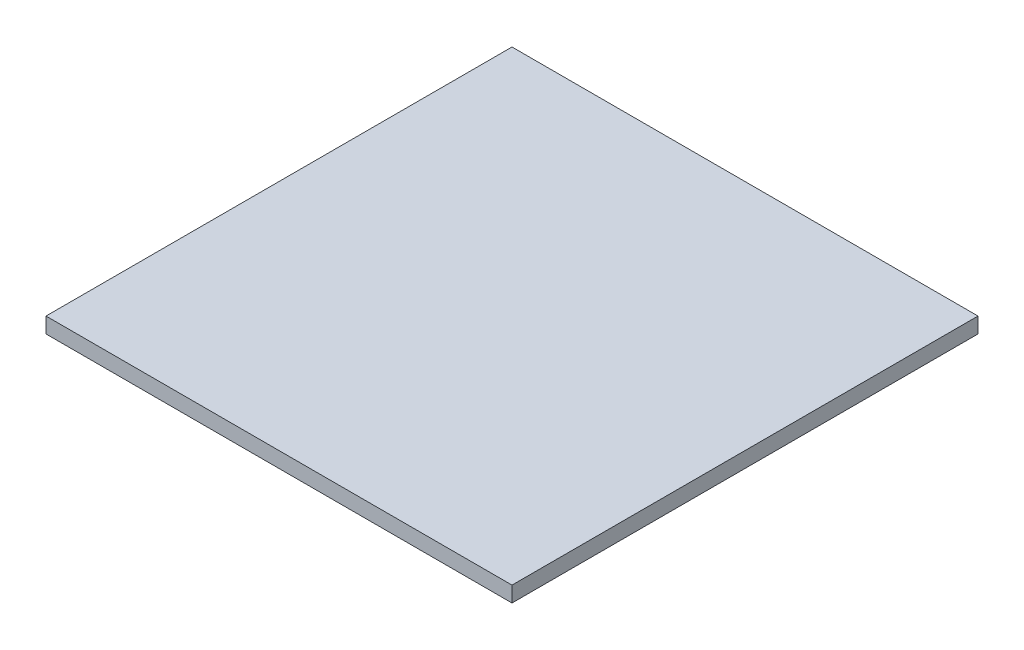
ISO-10303-21;
HEADER;
FILE_DESCRIPTION(('STEP AP214'),'2;1');
FILE_NAME('part.step','',(''),(''),'','','');
FILE_SCHEMA(('AUTOMOTIVE_DESIGN { 1 0 10303 214 1 1 1 1 }'));
ENDSEC;
DATA;
#1=APPLICATION_CONTEXT('core data for automotive mechanical design processes');
#2=APPLICATION_PROTOCOL_DEFINITION('international standard','automotive_design',2000,#1);
#3=PRODUCT_CONTEXT('',#1,'mechanical');
#4=PRODUCT('Part','Part','',(#3));
#5=PRODUCT_RELATED_PRODUCT_CATEGORY('part','',(#4));
#6=PRODUCT_DEFINITION_FORMATION('','',#4);
#7=PRODUCT_DEFINITION_CONTEXT('part definition',#1,'design');
#8=PRODUCT_DEFINITION('design','',#6,#7);
#9=PRODUCT_DEFINITION_SHAPE('','',#8);
#10=(LENGTH_UNIT() NAMED_UNIT(*) SI_UNIT(.MILLI.,.METRE.));
#11=(NAMED_UNIT(*) PLANE_ANGLE_UNIT() SI_UNIT($,.RADIAN.));
#12=(NAMED_UNIT(*) SI_UNIT($,.STERADIAN.) SOLID_ANGLE_UNIT());
#13=UNCERTAINTY_MEASURE_WITH_UNIT(LENGTH_MEASURE(1.E-05),#10,'distance_accuracy_value','');
#14=(GEOMETRIC_REPRESENTATION_CONTEXT(3) GLOBAL_UNCERTAINTY_ASSIGNED_CONTEXT((#13)) GLOBAL_UNIT_ASSIGNED_CONTEXT((#10,
#11,#12)) REPRESENTATION_CONTEXT('',''));
#15=CARTESIAN_POINT('',(0.,0.,0.));
#16=DIRECTION('',(0.,0.,1.));
#17=DIRECTION('',(1.,0.,0.));
#18=AXIS2_PLACEMENT_3D('',#15,#16,#17);
#19=CARTESIAN_POINT('',(300.,10.,300.));
#20=DIRECTION('',(-1.,0.,0.));
#21=DIRECTION('',(0.,0.,1.));
#22=AXIS2_PLACEMENT_3D('',#19,#20,#21);
#23=PLANE('',#22);
#24=DIRECTION('',(0.,0.,-1.));
#25=VECTOR('',#24,1.);
#26=CARTESIAN_POINT('',(300.,-10.,300.));
#27=LINE('',#26,#25);
#28=CARTESIAN_POINT('',(300.,-10.,300.));
#29=VERTEX_POINT('',#28);
#30=CARTESIAN_POINT('',(300.,-10.,-300.));
#31=VERTEX_POINT('',#30);
#32=EDGE_CURVE('E115',#29,#31,#27,.T.);
#33=ORIENTED_EDGE('',*,*,#32,.T.);
#34=DIRECTION('',(0.,-1.,0.));
#35=VECTOR('',#34,1.);
#36=CARTESIAN_POINT('',(300.,10.,-300.));
#37=LINE('',#36,#35);
#38=CARTESIAN_POINT('',(300.,10.,-300.));
#39=VERTEX_POINT('',#38);
#40=EDGE_CURVE('E11',#39,#31,#37,.T.);
#41=ORIENTED_EDGE('',*,*,#40,.F.);
#42=DIRECTION('',(0.,0.,-1.));
#43=VECTOR('',#42,1.);
#44=CARTESIAN_POINT('',(300.,10.,300.));
#45=LINE('',#44,#43);
#46=CARTESIAN_POINT('',(300.,10.,300.));
#47=VERTEX_POINT('',#46);
#48=EDGE_CURVE('E99',#47,#39,#45,.T.);
#49=ORIENTED_EDGE('',*,*,#48,.F.);
#50=DIRECTION('',(0.,-1.,0.));
#51=VECTOR('',#50,1.);
#52=CARTESIAN_POINT('',(300.,10.,300.));
#53=LINE('',#52,#51);
#54=EDGE_CURVE('E111',#47,#29,#53,.T.);
#55=ORIENTED_EDGE('',*,*,#54,.T.);
#56=EDGE_LOOP('',(#33,#41,#49,#55));
#57=FACE_BOUND('',#56,.T.);
#58=ADVANCED_FACE('F47',(#57),#23,.F.);
#59=CARTESIAN_POINT('',(-300.,10.,-300.));
#60=DIRECTION('',(0.,0.,1.));
#61=DIRECTION('',(1.,0.,0.));
#62=AXIS2_PLACEMENT_3D('',#59,#60,#61);
#63=PLANE('',#62);
#64=DIRECTION('',(-1.,0.,0.));
#65=VECTOR('',#64,1.);
#66=CARTESIAN_POINT('',(-300.,-10.,-300.));
#67=LINE('',#66,#65);
#68=CARTESIAN_POINT('',(-300.,-10.,-300.));
#69=VERTEX_POINT('',#68);
#70=EDGE_CURVE('E104',#31,#69,#67,.T.);
#71=ORIENTED_EDGE('',*,*,#70,.T.);
#72=DIRECTION('',(0.,-1.,0.));
#73=VECTOR('',#72,1.);
#74=CARTESIAN_POINT('',(-300.,10.,-300.));
#75=LINE('',#74,#73);
#76=CARTESIAN_POINT('',(-300.,10.,-300.));
#77=VERTEX_POINT('',#76);
#78=EDGE_CURVE('E56',#77,#69,#75,.T.);
#79=ORIENTED_EDGE('',*,*,#78,.F.);
#80=DIRECTION('',(-1.,0.,0.));
#81=VECTOR('',#80,1.);
#82=CARTESIAN_POINT('',(-300.,10.,-300.));
#83=LINE('',#82,#81);
#84=EDGE_CURVE('E94',#39,#77,#83,.T.);
#85=ORIENTED_EDGE('',*,*,#84,.F.);
#86=ORIENTED_EDGE('',*,*,#40,.T.);
#87=EDGE_LOOP('',(#71,#79,#85,#86));
#88=FACE_BOUND('',#87,.T.);
#89=ADVANCED_FACE('F103',(#88),#63,.F.);
#90=CARTESIAN_POINT('',(-300.,10.,300.));
#91=DIRECTION('',(1.,0.,0.));
#92=DIRECTION('',(0.,0.,-1.));
#93=AXIS2_PLACEMENT_3D('',#90,#91,#92);
#94=PLANE('',#93);
#95=DIRECTION('',(0.,0.,1.));
#96=VECTOR('',#95,1.);
#97=CARTESIAN_POINT('',(-300.,-10.,300.));
#98=LINE('',#97,#96);
#99=CARTESIAN_POINT('',(-300.,-10.,300.));
#100=VERTEX_POINT('',#99);
#101=EDGE_CURVE('E81',#69,#100,#98,.T.);
#102=ORIENTED_EDGE('',*,*,#101,.T.);
#103=DIRECTION('',(0.,-1.,0.));
#104=VECTOR('',#103,1.);
#105=CARTESIAN_POINT('',(-300.,10.,300.));
#106=LINE('',#105,#104);
#107=CARTESIAN_POINT('',(-300.,10.,300.));
#108=VERTEX_POINT('',#107);
#109=EDGE_CURVE('E106',#108,#100,#106,.T.);
#110=ORIENTED_EDGE('',*,*,#109,.F.);
#111=DIRECTION('',(0.,0.,1.));
#112=VECTOR('',#111,1.);
#113=CARTESIAN_POINT('',(-300.,10.,300.));
#114=LINE('',#113,#112);
#115=EDGE_CURVE('E97',#77,#108,#114,.T.);
#116=ORIENTED_EDGE('',*,*,#115,.F.);
#117=ORIENTED_EDGE('',*,*,#78,.T.);
#118=EDGE_LOOP('',(#102,#110,#116,#117));
#119=FACE_BOUND('',#118,.T.);
#120=ADVANCED_FACE('F107',(#119),#94,.F.);
#121=CARTESIAN_POINT('',(-300.,10.,300.));
#122=DIRECTION('',(0.,0.,-1.));
#123=DIRECTION('',(-1.,0.,0.));
#124=AXIS2_PLACEMENT_3D('',#121,#122,#123);
#125=PLANE('',#124);
#126=DIRECTION('',(1.,0.,0.));
#127=VECTOR('',#126,1.);
#128=CARTESIAN_POINT('',(-300.,-10.,300.));
#129=LINE('',#128,#127);
#130=EDGE_CURVE('E87',#100,#29,#129,.T.);
#131=ORIENTED_EDGE('',*,*,#130,.T.);
#132=ORIENTED_EDGE('',*,*,#54,.F.);
#133=DIRECTION('',(1.,0.,0.));
#134=VECTOR('',#133,1.);
#135=CARTESIAN_POINT('',(-300.,10.,300.));
#136=LINE('',#135,#134);
#137=EDGE_CURVE('E64',#108,#47,#136,.T.);
#138=ORIENTED_EDGE('',*,*,#137,.F.);
#139=ORIENTED_EDGE('',*,*,#109,.T.);
#140=EDGE_LOOP('',(#131,#132,#138,#139));
#141=FACE_BOUND('',#140,.T.);
#142=ADVANCED_FACE('F128',(#141),#125,.F.);
#143=CARTESIAN_POINT('',(0.,10.,0.));
#144=DIRECTION('',(0.,-1.,0.));
#145=DIRECTION('',(0.,0.,-1.));
#146=AXIS2_PLACEMENT_3D('',#143,#144,#145);
#147=PLANE('',#146);
#148=ORIENTED_EDGE('',*,*,#48,.T.);
#149=ORIENTED_EDGE('',*,*,#84,.T.);
#150=ORIENTED_EDGE('',*,*,#115,.T.);
#151=ORIENTED_EDGE('',*,*,#137,.T.);
#152=EDGE_LOOP('',(#148,#149,#150,#151));
#153=FACE_BOUND('',#152,.T.);
#154=ADVANCED_FACE('F95',(#153),#147,.F.);
#155=CARTESIAN_POINT('',(0.,-10.,0.));
#156=DIRECTION('',(0.,-1.,0.));
#157=DIRECTION('',(0.,0.,-1.));
#158=AXIS2_PLACEMENT_3D('',#155,#156,#157);
#159=PLANE('',#158);
#160=ORIENTED_EDGE('',*,*,#32,.F.);
#161=ORIENTED_EDGE('',*,*,#130,.F.);
#162=ORIENTED_EDGE('',*,*,#101,.F.);
#163=ORIENTED_EDGE('',*,*,#70,.F.);
#164=EDGE_LOOP('',(#160,#161,#162,#163));
#165=FACE_BOUND('',#164,.T.);
#166=ADVANCED_FACE('F131',(#165),#159,.T.);
#167=CLOSED_SHELL('',(#58,#89,#120,#142,#154,#166));
#168=MANIFOLD_SOLID_BREP('B2',#167);
#169=ADVANCED_BREP_SHAPE_REPRESENTATION('',(#18,#168),#14);
#170=SHAPE_DEFINITION_REPRESENTATION(#9,#169);
ENDSEC;
END-ISO-10303-21;
